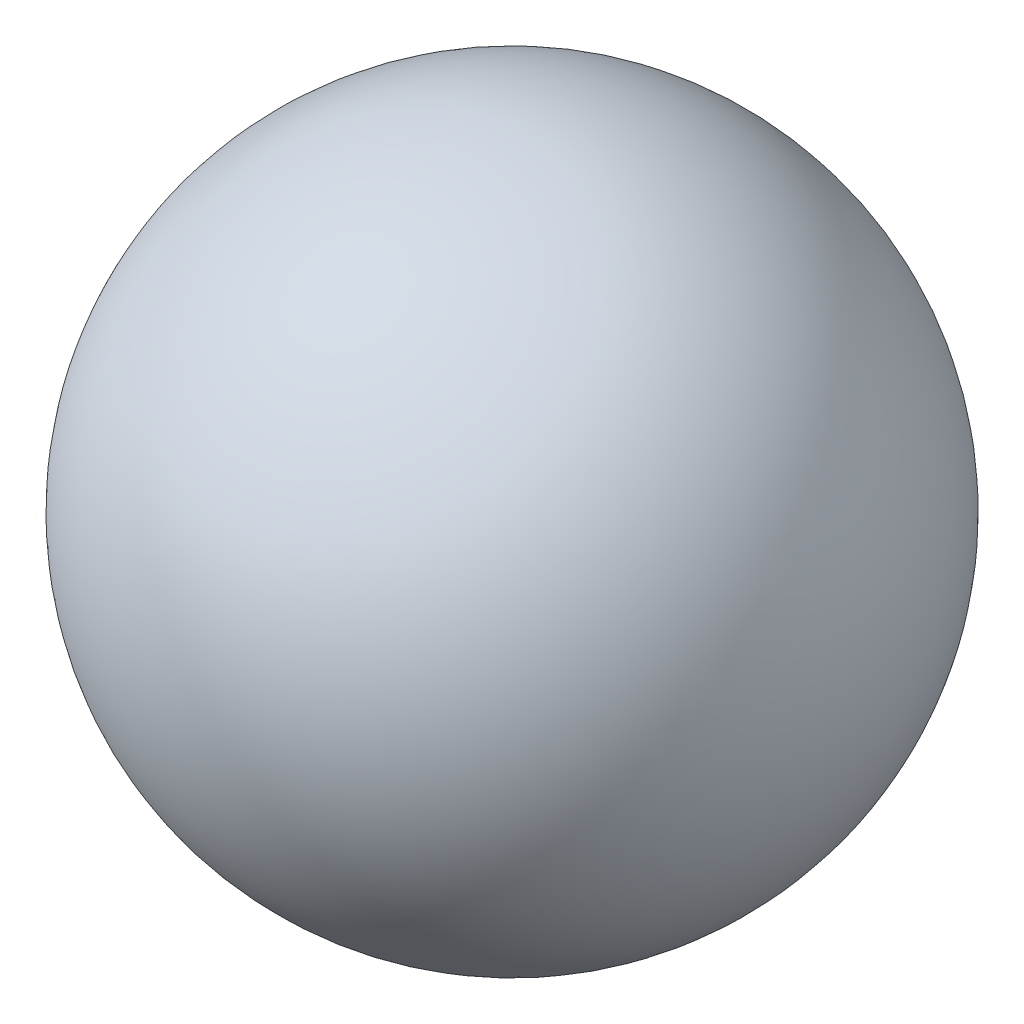
ISO-10303-21;
HEADER;
FILE_DESCRIPTION(('STEP AP214'),'2;1');
FILE_NAME('part.step','',(''),(''),'','','');
FILE_SCHEMA(('AUTOMOTIVE_DESIGN { 1 0 10303 214 1 1 1 1 }'));
ENDSEC;
DATA;
#1=APPLICATION_CONTEXT('core data for automotive mechanical design processes');
#2=APPLICATION_PROTOCOL_DEFINITION('international standard','automotive_design',2000,#1);
#3=PRODUCT_CONTEXT('',#1,'mechanical');
#4=PRODUCT('Part','Part','',(#3));
#5=PRODUCT_RELATED_PRODUCT_CATEGORY('part','',(#4));
#6=PRODUCT_DEFINITION_FORMATION('','',#4);
#7=PRODUCT_DEFINITION_CONTEXT('part definition',#1,'design');
#8=PRODUCT_DEFINITION('design','',#6,#7);
#9=PRODUCT_DEFINITION_SHAPE('','',#8);
#10=(LENGTH_UNIT() NAMED_UNIT(*) SI_UNIT(.MILLI.,.METRE.));
#11=(NAMED_UNIT(*) PLANE_ANGLE_UNIT() SI_UNIT($,.RADIAN.));
#12=(NAMED_UNIT(*) SI_UNIT($,.STERADIAN.) SOLID_ANGLE_UNIT());
#13=UNCERTAINTY_MEASURE_WITH_UNIT(LENGTH_MEASURE(1.E-05),#10,'distance_accuracy_value','');
#14=(GEOMETRIC_REPRESENTATION_CONTEXT(3) GLOBAL_UNCERTAINTY_ASSIGNED_CONTEXT((#13)) GLOBAL_UNIT_ASSIGNED_CONTEXT((#10,
#11,#12)) REPRESENTATION_CONTEXT('',''));
#15=CARTESIAN_POINT('',(0.,0.,0.));
#16=DIRECTION('',(0.,0.,1.));
#17=DIRECTION('',(1.,0.,0.));
#18=AXIS2_PLACEMENT_3D('',#15,#16,#17);
#19=CARTESIAN_POINT('',(7.,30.,0.));
#20=DIRECTION('',(1.,0.,0.));
#21=DIRECTION('',(0.,1.,0.));
#22=AXIS2_PLACEMENT_3D('',#19,#20,#21);
#23=SPHERICAL_SURFACE('',#22,3.572);
#24=CARTESIAN_POINT('',(10.572,30.,0.));
#25=VERTEX_POINT('',#24);
#26=VERTEX_LOOP('',#25);
#27=FACE_BOUND('',#26,.T.);
#28=ADVANCED_FACE('F27',(#27),#23,.T.);
#29=CLOSED_SHELL('',(#28));
#30=MANIFOLD_SOLID_BREP('B2',#29);
#31=ADVANCED_BREP_SHAPE_REPRESENTATION('',(#18,#30),#14);
#32=SHAPE_DEFINITION_REPRESENTATION(#9,#31);
ENDSEC;
END-ISO-10303-21;
